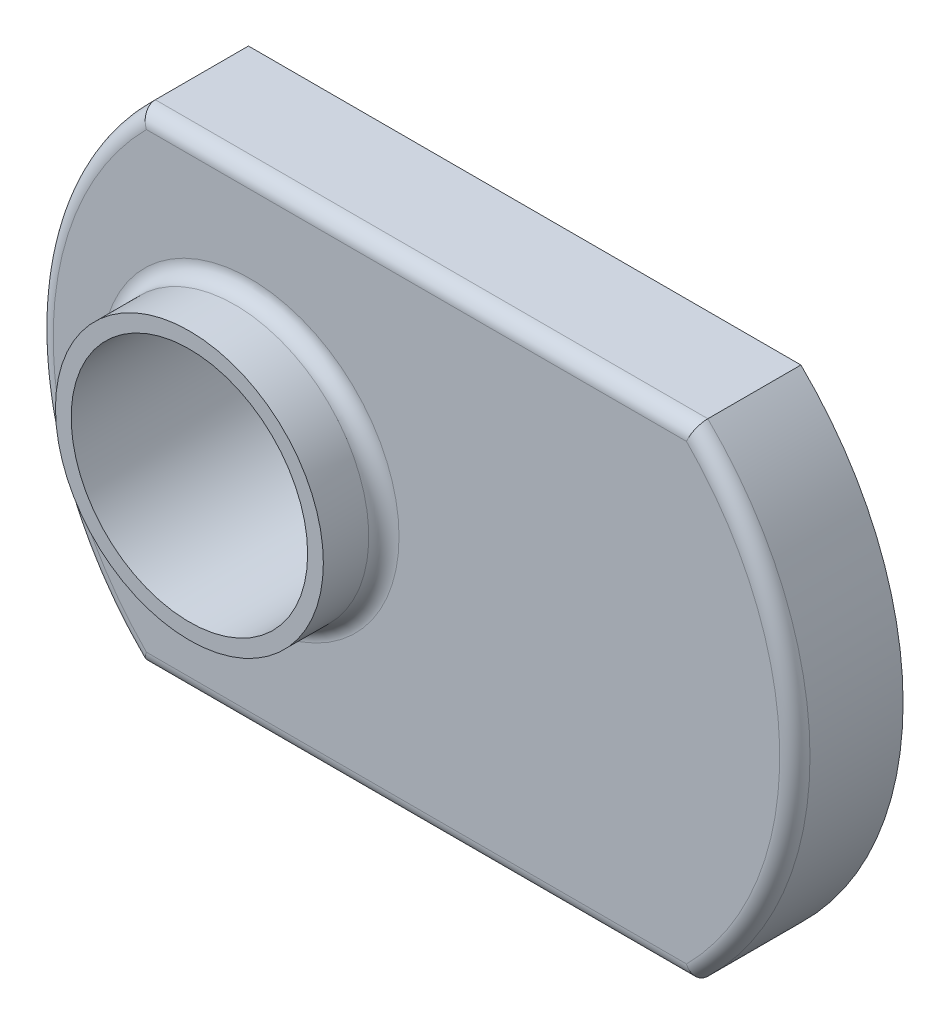
ISO-10303-21;
HEADER;
FILE_DESCRIPTION(('STEP AP214'),'2;1');
FILE_NAME('part.step','',(''),(''),'','','');
FILE_SCHEMA(('AUTOMOTIVE_DESIGN { 1 0 10303 214 1 1 1 1 }'));
ENDSEC;
DATA;
#1=APPLICATION_CONTEXT('core data for automotive mechanical design processes');
#2=APPLICATION_PROTOCOL_DEFINITION('international standard','automotive_design',2000,#1);
#3=PRODUCT_CONTEXT('',#1,'mechanical');
#4=PRODUCT('Part','Part','',(#3));
#5=PRODUCT_RELATED_PRODUCT_CATEGORY('part','',(#4));
#6=PRODUCT_DEFINITION_FORMATION('','',#4);
#7=PRODUCT_DEFINITION_CONTEXT('part definition',#1,'design');
#8=PRODUCT_DEFINITION('design','',#6,#7);
#9=PRODUCT_DEFINITION_SHAPE('','',#8);
#10=(LENGTH_UNIT() NAMED_UNIT(*) SI_UNIT(.MILLI.,.METRE.));
#11=(NAMED_UNIT(*) PLANE_ANGLE_UNIT() SI_UNIT($,.RADIAN.));
#12=(NAMED_UNIT(*) SI_UNIT($,.STERADIAN.) SOLID_ANGLE_UNIT());
#13=UNCERTAINTY_MEASURE_WITH_UNIT(LENGTH_MEASURE(1.E-05),#10,'distance_accuracy_value','');
#14=(GEOMETRIC_REPRESENTATION_CONTEXT(3) GLOBAL_UNCERTAINTY_ASSIGNED_CONTEXT((#13)) GLOBAL_UNIT_ASSIGNED_CONTEXT((#10,
#11,#12)) REPRESENTATION_CONTEXT('',''));
#15=CARTESIAN_POINT('',(0.,0.,0.));
#16=DIRECTION('',(0.,0.,1.));
#17=DIRECTION('',(1.,0.,0.));
#18=AXIS2_PLACEMENT_3D('',#15,#16,#17);
#19=CARTESIAN_POINT('',(0.,16.2052,-3.6322));
#20=DIRECTION('',(0.,0.,-1.));
#21=DIRECTION('',(-1.,0.,0.));
#22=AXIS2_PLACEMENT_3D('',#19,#20,#21);
#23=PLANE('',#22);
#24=CARTESIAN_POINT('',(11.2875718518519,8.1026,-3.6322));
#25=DIRECTION('',(0.,0.,-1.));
#26=DIRECTION('',(-1.,0.,0.));
#27=AXIS2_PLACEMENT_3D('',#24,#25,#26);
#28=CIRCLE('',#27,11.2875718518519);
#29=CARTESIAN_POINT('',(3.429,16.2052,-3.6322));
#30=VERTEX_POINT('',#29);
#31=CARTESIAN_POINT('',(3.429,0.,-3.6322));
#32=VERTEX_POINT('',#31);
#33=EDGE_CURVE('E94',#30,#32,#28,.F.);
#34=ORIENTED_EDGE('',*,*,#33,.F.);
#35=DIRECTION('',(-1.,0.,0.));
#36=VECTOR('',#35,1.);
#37=CARTESIAN_POINT('',(0.,16.2052,-3.6322));
#38=LINE('',#37,#36);
#39=CARTESIAN_POINT('',(21.971,16.2052,-3.6322));
#40=VERTEX_POINT('',#39);
#41=EDGE_CURVE('E90',#40,#30,#38,.T.);
#42=ORIENTED_EDGE('',*,*,#41,.F.);
#43=CARTESIAN_POINT('',(14.1124281481481,8.1026,-3.6322));
#44=DIRECTION('',(0.,0.,-1.));
#45=DIRECTION('',(-1.,0.,0.));
#46=AXIS2_PLACEMENT_3D('',#43,#44,#45);
#47=CIRCLE('',#46,11.2875718518519);
#48=CARTESIAN_POINT('',(21.971,0.,-3.6322));
#49=VERTEX_POINT('',#48);
#50=EDGE_CURVE('E93',#40,#49,#47,.T.);
#51=ORIENTED_EDGE('',*,*,#50,.T.);
#52=DIRECTION('',(1.,0.,0.));
#53=VECTOR('',#52,1.);
#54=CARTESIAN_POINT('',(0.,0.,-3.6322));
#55=LINE('',#54,#53);
#56=EDGE_CURVE('E106',#32,#49,#55,.T.);
#57=ORIENTED_EDGE('',*,*,#56,.F.);
#58=EDGE_LOOP('',(#34,#42,#51,#57));
#59=FACE_BOUND('',#58,.T.);
#60=CARTESIAN_POINT('',(7.112,8.1026,-3.6322));
#61=DIRECTION('',(0.,0.,-1.));
#62=DIRECTION('',(-1.,0.,0.));
#63=AXIS2_PLACEMENT_3D('',#60,#61,#62);
#64=CIRCLE('',#63,3.96875);
#65=CARTESIAN_POINT('',(3.14325,8.1026,-3.6322));
#66=VERTEX_POINT('',#65);
#67=EDGE_CURVE('E114',#66,#66,#64,.T.);
#68=ORIENTED_EDGE('',*,*,#67,.F.);
#69=EDGE_LOOP('',(#68));
#70=FACE_BOUND('',#69,.T.);
#71=ADVANCED_FACE('F30',(#59,#70),#23,.T.);
#72=CARTESIAN_POINT('',(0.,16.2052,0.));
#73=DIRECTION('',(0.,0.,-1.));
#74=DIRECTION('',(-1.,0.,0.));
#75=AXIS2_PLACEMENT_3D('',#72,#73,#74);
#76=PLANE('',#75);
#77=CARTESIAN_POINT('',(14.1124281481481,8.1026,0.));
#78=DIRECTION('',(0.,0.,-1.));
#79=DIRECTION('',(-1.,0.,0.));
#80=AXIS2_PLACEMENT_3D('',#77,#78,#79);
#81=CIRCLE('',#80,10.7795718518519);
#82=CARTESIAN_POINT('',(21.7623444973141,0.508000000000002,0.));
#83=VERTEX_POINT('',#82);
#84=CARTESIAN_POINT('',(21.7623444973141,15.6972,0.));
#85=VERTEX_POINT('',#84);
#86=EDGE_CURVE('E123',#83,#85,#81,.F.);
#87=ORIENTED_EDGE('',*,*,#86,.T.);
#88=DIRECTION('',(-1.,0.,0.));
#89=VECTOR('',#88,1.);
#90=CARTESIAN_POINT('',(3.429,15.6972,0.));
#91=LINE('',#90,#89);
#92=CARTESIAN_POINT('',(3.63765550268588,15.6972,0.));
#93=VERTEX_POINT('',#92);
#94=EDGE_CURVE('E125',#85,#93,#91,.T.);
#95=ORIENTED_EDGE('',*,*,#94,.T.);
#96=CARTESIAN_POINT('',(11.2875718518519,8.1026,0.));
#97=DIRECTION('',(0.,0.,-1.));
#98=DIRECTION('',(-1.,0.,0.));
#99=AXIS2_PLACEMENT_3D('',#96,#97,#98);
#100=CIRCLE('',#99,10.7795718518519);
#101=CARTESIAN_POINT('',(3.63765550268588,0.508000000000002,0.));
#102=VERTEX_POINT('',#101);
#103=EDGE_CURVE('E119',#93,#102,#100,.F.);
#104=ORIENTED_EDGE('',*,*,#103,.T.);
#105=DIRECTION('',(1.,0.,0.));
#106=VECTOR('',#105,1.);
#107=CARTESIAN_POINT('',(21.971,0.508000000000002,0.));
#108=LINE('',#107,#106);
#109=EDGE_CURVE('E121',#102,#83,#108,.T.);
#110=ORIENTED_EDGE('',*,*,#109,.T.);
#111=EDGE_LOOP('',(#87,#95,#104,#110));
#112=FACE_BOUND('',#111,.T.);
#113=CARTESIAN_POINT('',(7.112,8.1026,0.));
#114=DIRECTION('',(0.,0.,-1.));
#115=DIRECTION('',(-1.,0.,0.));
#116=AXIS2_PLACEMENT_3D('',#113,#114,#115);
#117=CIRCLE('',#116,5.0038);
#118=CARTESIAN_POINT('',(2.1082,8.1026,0.));
#119=VERTEX_POINT('',#118);
#120=EDGE_CURVE('E108',#119,#119,#117,.T.);
#121=ORIENTED_EDGE('',*,*,#120,.T.);
#122=EDGE_LOOP('',(#121));
#123=FACE_BOUND('',#122,.T.);
#124=ADVANCED_FACE('F200',(#112,#123),#76,.F.);
#125=CARTESIAN_POINT('',(0.,16.2052,-3.6322));
#126=DIRECTION('',(0.,1.,0.));
#127=DIRECTION('',(0.,0.,1.));
#128=AXIS2_PLACEMENT_3D('',#125,#126,#127);
#129=PLANE('',#128);
#130=DIRECTION('',(0.,0.,-1.));
#131=VECTOR('',#130,1.);
#132=CARTESIAN_POINT('',(3.429,16.2052,42.8615004012134));
#133=LINE('',#132,#131);
#134=CARTESIAN_POINT('',(3.429,16.2052,-0.507999999999995));
#135=VERTEX_POINT('',#134);
#136=EDGE_CURVE('E133',#135,#30,#133,.T.);
#137=ORIENTED_EDGE('',*,*,#136,.F.);
#138=DIRECTION('',(-1.,0.,0.));
#139=VECTOR('',#138,1.);
#140=CARTESIAN_POINT('',(21.971,16.2052,-0.508));
#141=LINE('',#140,#139);
#142=CARTESIAN_POINT('',(21.971,16.2052,-0.507999999999995));
#143=VERTEX_POINT('',#142);
#144=EDGE_CURVE('E92',#135,#143,#141,.F.);
#145=ORIENTED_EDGE('',*,*,#144,.T.);
#146=DIRECTION('',(0.,0.,-1.));
#147=VECTOR('',#146,1.);
#148=CARTESIAN_POINT('',(21.971,16.2052,42.8615004012134));
#149=LINE('',#148,#147);
#150=EDGE_CURVE('E85',#143,#40,#149,.T.);
#151=ORIENTED_EDGE('',*,*,#150,.T.);
#152=ORIENTED_EDGE('',*,*,#41,.T.);
#153=EDGE_LOOP('',(#137,#145,#151,#152));
#154=FACE_BOUND('',#153,.T.);
#155=ADVANCED_FACE('F88',(#154),#129,.T.);
#156=CARTESIAN_POINT('',(0.,0.,-3.6322));
#157=DIRECTION('',(0.,-1.,0.));
#158=DIRECTION('',(0.,0.,-1.));
#159=AXIS2_PLACEMENT_3D('',#156,#157,#158);
#160=PLANE('',#159);
#161=DIRECTION('',(0.,0.,-1.));
#162=VECTOR('',#161,1.);
#163=CARTESIAN_POINT('',(21.971,0.,42.8615004012134));
#164=LINE('',#163,#162);
#165=CARTESIAN_POINT('',(21.971,0.,-0.507999999999995));
#166=VERTEX_POINT('',#165);
#167=EDGE_CURVE('E98',#49,#166,#164,.F.);
#168=ORIENTED_EDGE('',*,*,#167,.T.);
#169=DIRECTION('',(1.,0.,0.));
#170=VECTOR('',#169,1.);
#171=CARTESIAN_POINT('',(3.429,0.,-0.508));
#172=LINE('',#171,#170);
#173=CARTESIAN_POINT('',(3.429,0.,-0.507999999999995));
#174=VERTEX_POINT('',#173);
#175=EDGE_CURVE('E45',#166,#174,#172,.F.);
#176=ORIENTED_EDGE('',*,*,#175,.T.);
#177=DIRECTION('',(0.,0.,-1.));
#178=VECTOR('',#177,1.);
#179=CARTESIAN_POINT('',(3.429,0.,42.8615004012134));
#180=LINE('',#179,#178);
#181=EDGE_CURVE('E134',#174,#32,#180,.T.);
#182=ORIENTED_EDGE('',*,*,#181,.T.);
#183=ORIENTED_EDGE('',*,*,#56,.T.);
#184=EDGE_LOOP('',(#168,#176,#182,#183));
#185=FACE_BOUND('',#184,.T.);
#186=ADVANCED_FACE('F32',(#185),#160,.T.);
#187=CARTESIAN_POINT('',(7.112,8.1026,2.032));
#188=DIRECTION('',(0.,0.,-1.));
#189=DIRECTION('',(-1.,0.,0.));
#190=AXIS2_PLACEMENT_3D('',#187,#188,#189);
#191=CYLINDRICAL_SURFACE('',#190,4.4958);
#192=CARTESIAN_POINT('',(7.112,8.1026,0.508));
#193=DIRECTION('',(0.,0.,-1.));
#194=DIRECTION('',(-1.,0.,0.));
#195=AXIS2_PLACEMENT_3D('',#192,#193,#194);
#196=CIRCLE('',#195,4.4958);
#197=CARTESIAN_POINT('',(2.6162,8.1026,0.508));
#198=VERTEX_POINT('',#197);
#199=EDGE_CURVE('E11',#198,#198,#196,.F.);
#200=ORIENTED_EDGE('',*,*,#199,.T.);
#201=EDGE_LOOP('',(#200));
#202=FACE_BOUND('',#201,.T.);
#203=CARTESIAN_POINT('',(7.112,8.1026,2.032));
#204=DIRECTION('',(0.,0.,1.));
#205=DIRECTION('',(1.,0.,0.));
#206=AXIS2_PLACEMENT_3D('',#203,#204,#205);
#207=CIRCLE('',#206,4.4958);
#208=CARTESIAN_POINT('',(11.6078,8.1026,2.032));
#209=VERTEX_POINT('',#208);
#210=EDGE_CURVE('E110',#209,#209,#207,.T.);
#211=ORIENTED_EDGE('',*,*,#210,.F.);
#212=EDGE_LOOP('',(#211));
#213=FACE_BOUND('',#212,.T.);
#214=ADVANCED_FACE('F195',(#202,#213),#191,.T.);
#215=CARTESIAN_POINT('',(7.112,8.1026,2.032));
#216=DIRECTION('',(0.,0.,1.));
#217=DIRECTION('',(1.,0.,0.));
#218=AXIS2_PLACEMENT_3D('',#215,#216,#217);
#219=PLANE('',#218);
#220=CARTESIAN_POINT('',(7.112,8.1026,2.032));
#221=DIRECTION('',(0.,0.,1.));
#222=DIRECTION('',(1.,0.,0.));
#223=AXIS2_PLACEMENT_3D('',#220,#221,#222);
#224=CIRCLE('',#223,3.96875);
#225=CARTESIAN_POINT('',(11.08075,8.1026,2.032));
#226=VERTEX_POINT('',#225);
#227=EDGE_CURVE('E101',#226,#226,#224,.T.);
#228=ORIENTED_EDGE('',*,*,#227,.F.);
#229=EDGE_LOOP('',(#228));
#230=FACE_BOUND('',#229,.T.);
#231=ORIENTED_EDGE('',*,*,#210,.T.);
#232=EDGE_LOOP('',(#231));
#233=FACE_BOUND('',#232,.T.);
#234=ADVANCED_FACE('F191',(#230,#233),#219,.T.);
#235=CARTESIAN_POINT('',(7.112,8.1026,2.032));
#236=DIRECTION('',(0.,0.,1.));
#237=DIRECTION('',(1.,0.,0.));
#238=AXIS2_PLACEMENT_3D('',#235,#236,#237);
#239=CYLINDRICAL_SURFACE('',#238,3.96875);
#240=ORIENTED_EDGE('',*,*,#67,.T.);
#241=EDGE_LOOP('',(#240));
#242=FACE_BOUND('',#241,.T.);
#243=ORIENTED_EDGE('',*,*,#227,.T.);
#244=EDGE_LOOP('',(#243));
#245=FACE_BOUND('',#244,.T.);
#246=ADVANCED_FACE('F188',(#242,#245),#239,.F.);
#247=CARTESIAN_POINT('',(14.1124281481481,8.1026,42.8615004012134));
#248=DIRECTION('',(0.,0.,-1.));
#249=DIRECTION('',(-1.,0.,0.));
#250=AXIS2_PLACEMENT_3D('',#247,#248,#249);
#251=CYLINDRICAL_SURFACE('',#250,11.2875718518519);
#252=ORIENTED_EDGE('',*,*,#150,.F.);
#253=CARTESIAN_POINT('',(14.1124281481481,8.1026,-0.508000000000002));
#254=DIRECTION('',(0.,0.,-1.));
#255=DIRECTION('',(-1.,0.,0.));
#256=AXIS2_PLACEMENT_3D('',#253,#254,#255);
#257=CIRCLE('',#256,11.2875718518519);
#258=EDGE_CURVE('E53',#143,#166,#257,.T.);
#259=ORIENTED_EDGE('',*,*,#258,.T.);
#260=ORIENTED_EDGE('',*,*,#167,.F.);
#261=ORIENTED_EDGE('',*,*,#50,.F.);
#262=EDGE_LOOP('',(#252,#259,#260,#261));
#263=FACE_BOUND('',#262,.T.);
#264=ADVANCED_FACE('F97',(#263),#251,.T.);
#265=CARTESIAN_POINT('',(11.2875718518519,8.1026,42.8615004012134));
#266=DIRECTION('',(0.,0.,-1.));
#267=DIRECTION('',(-1.,0.,0.));
#268=AXIS2_PLACEMENT_3D('',#265,#266,#267);
#269=CYLINDRICAL_SURFACE('',#268,11.2875718518519);
#270=ORIENTED_EDGE('',*,*,#181,.F.);
#271=CARTESIAN_POINT('',(11.2875718518519,8.1026,-0.508000000000002));
#272=DIRECTION('',(0.,0.,-1.));
#273=DIRECTION('',(-1.,0.,0.));
#274=AXIS2_PLACEMENT_3D('',#271,#272,#273);
#275=CIRCLE('',#274,11.2875718518519);
#276=EDGE_CURVE('E38',#174,#135,#275,.T.);
#277=ORIENTED_EDGE('',*,*,#276,.T.);
#278=ORIENTED_EDGE('',*,*,#136,.T.);
#279=ORIENTED_EDGE('',*,*,#33,.T.);
#280=EDGE_LOOP('',(#270,#277,#278,#279));
#281=FACE_BOUND('',#280,.T.);
#282=ADVANCED_FACE('F132',(#281),#269,.T.);
#283=CARTESIAN_POINT('',(0.,0.508000000000002,-0.508));
#284=DIRECTION('',(-1.,0.,0.));
#285=DIRECTION('',(0.,0.,1.));
#286=AXIS2_PLACEMENT_3D('',#283,#284,#285);
#287=CYLINDRICAL_SURFACE('',#286,0.508);
#288=CARTESIAN_POINT('',(3.429,0.,-0.507999999999995));
#289=CARTESIAN_POINT('',(3.42898831408873,-3.02343132654079E-05,-0.480934929983784));
#290=CARTESIAN_POINT('',(3.42987577116847,0.00216086007702355,-0.453889000468113));
#291=CARTESIAN_POINT('',(3.43335740954221,0.0107492954829233,-0.400658792363404));
#292=CARTESIAN_POINT('',(3.43594696420116,0.0171352340603573,-0.374472379461493));
#293=CARTESIAN_POINT('',(3.44274134413607,0.0338773223076329,-0.323635763879901));
#294=CARTESIAN_POINT('',(3.44694579866978,0.0442325607204053,-0.298985210112334));
#295=CARTESIAN_POINT('',(3.45681709724883,0.0685180262978959,-0.25183042009043));
#296=CARTESIAN_POINT('',(3.46248444429352,0.0824494830964695,-0.229326925730963));
#297=CARTESIAN_POINT('',(3.47528598456966,0.113875901195409,-0.186348043574764));
#298=CARTESIAN_POINT('',(3.48245873014562,0.131464376187394,-0.165952699341788));
#299=CARTESIAN_POINT('',(3.49794194273445,0.16936999407787,-0.128386630849486));
#300=CARTESIAN_POINT('',(3.50625278001051,0.18968802496053,-0.111216960350431));
#301=CARTESIAN_POINT('',(3.52439660201551,0.233965863636031,-0.0793222945148613));
#302=CARTESIAN_POINT('',(3.53429522356558,0.258080613690416,-0.064850019415531));
#303=CARTESIAN_POINT('',(3.55486750608426,0.308093893455235,-0.0401543570889611));
#304=CARTESIAN_POINT('',(3.56554140291015,0.333992965874879,-0.0299322692841549));
#305=CARTESIAN_POINT('',(3.5860563944548,0.38366169651262,-0.0148534143694712));
#306=CARTESIAN_POINT('',(3.59584002476985,0.407305197961299,-0.00949390641682595));
#307=CARTESIAN_POINT('',(3.61561193452468,0.454993018299731,-0.00219948352200265));
#308=CARTESIAN_POINT('',(3.62559977654523,0.479036463353435,-0.000257894868614071));
#309=CARTESIAN_POINT('',(3.63628448235962,0.504706755631485,-7.98828955047341E-06));
#310=CARTESIAN_POINT('',(3.6369699818245,0.5063534638078,1.90879874667295E-08));
#311=CARTESIAN_POINT('',(3.63765550268588,0.508000000000002,0.));
#312=B_SPLINE_CURVE_WITH_KNOTS('',3,(#288,#289,#290,#291,#292,#293,#294,#295,#296,#297,#298,
#299,#300,#301,#302,#303,#304,#305,#306,#307,#308,#309,#310,#311),.UNSPECIFIED.,.F.,.F.,(4,2,2,
2,2,2,2,2,2,2,2,4),(0.,0.0810625141558323,0.161905590691538,0.242730118680012,0.323582474389546,
0.406835152389662,0.490114980189399,0.579180713389819,0.668273656935,0.746487412321688,
0.824548280129319,0.829899325590328),.UNSPECIFIED.);
#313=EDGE_CURVE('E150',#174,#102,#312,.T.);
#314=ORIENTED_EDGE('',*,*,#313,.F.);
#315=ORIENTED_EDGE('',*,*,#175,.F.);
#316=CARTESIAN_POINT('',(21.971,0.,-0.507999999999995));
#317=CARTESIAN_POINT('',(21.9710116859113,-3.02343132652233E-05,-0.480934929983784));
#318=CARTESIAN_POINT('',(21.9701242288315,0.0021608600770237,-0.453889000468113));
#319=CARTESIAN_POINT('',(21.9666425904578,0.0107492954829232,-0.400658792363405));
#320=CARTESIAN_POINT('',(21.9640530357988,0.0171352340603572,-0.374472379461494));
#321=CARTESIAN_POINT('',(21.9572586558639,0.0338773223076327,-0.323635763879901));
#322=CARTESIAN_POINT('',(21.9530542013302,0.0442325607204051,-0.298985210112334));
#323=CARTESIAN_POINT('',(21.9431829027512,0.0685180262978957,-0.25183042009043));
#324=CARTESIAN_POINT('',(21.9375155557065,0.0824494830964691,-0.229326925730963));
#325=CARTESIAN_POINT('',(21.9247140154303,0.113875901195409,-0.186348043574764));
#326=CARTESIAN_POINT('',(21.9175412698544,0.131464376187394,-0.165952699341788));
#327=CARTESIAN_POINT('',(21.9020580572655,0.16936999407787,-0.128386630849486));
#328=CARTESIAN_POINT('',(21.8937472199895,0.189688024960529,-0.111216960350432));
#329=CARTESIAN_POINT('',(21.8756033979845,0.233965863636029,-0.0793222945148624));
#330=CARTESIAN_POINT('',(21.8657047764344,0.258080613690414,-0.0648500194155324));
#331=CARTESIAN_POINT('',(21.8451324939157,0.308093893455233,-0.0401543570889621));
#332=CARTESIAN_POINT('',(21.8344585970898,0.333992965874878,-0.0299322692841556));
#333=CARTESIAN_POINT('',(21.8139436055452,0.383661696512619,-0.0148534143694715));
#334=CARTESIAN_POINT('',(21.8041599752301,0.407305197961297,-0.00949390641682631));
#335=CARTESIAN_POINT('',(21.7843880654753,0.454993018299729,-0.00219948352200298));
#336=CARTESIAN_POINT('',(21.7744002234548,0.479036463353434,-0.000257894868614442));
#337=CARTESIAN_POINT('',(21.7637155176404,0.504706755631485,-7.98828955052097E-06));
#338=CARTESIAN_POINT('',(21.7630300181755,0.5063534638078,1.90879874416342E-08));
#339=CARTESIAN_POINT('',(21.7623444973141,0.508000000000002,0.));
#340=B_SPLINE_CURVE_WITH_KNOTS('',3,(#316,#317,#318,#319,#320,#321,#322,#323,#324,#325,#326,
#327,#328,#329,#330,#331,#332,#333,#334,#335,#336,#337,#338,#339),.UNSPECIFIED.,.F.,.F.,(4,2,2,
2,2,2,2,2,2,2,2,4),(0.,0.0810625141558318,0.161905590691538,0.242730118680011,0.323582474389545,
0.406835152389661,0.490114980189398,0.579180713389816,0.668273656934998,0.746487412321686,
0.824548280129319,0.829899325590328),.UNSPECIFIED.);
#341=EDGE_CURVE('E139',#83,#166,#340,.F.);
#342=ORIENTED_EDGE('',*,*,#341,.F.);
#343=ORIENTED_EDGE('',*,*,#109,.F.);
#344=EDGE_LOOP('',(#314,#315,#342,#343));
#345=FACE_BOUND('',#344,.T.);
#346=ADVANCED_FACE('F178',(#345),#287,.T.);
#347=CARTESIAN_POINT('',(14.1124281481481,8.1026,-0.508000000000002));
#348=DIRECTION('',(0.,0.,-1.));
#349=DIRECTION('',(-1.,0.,0.));
#350=AXIS2_PLACEMENT_3D('',#347,#348,#349);
#351=TOROIDAL_SURFACE('',#350,10.7795718518519,0.508);
#352=ORIENTED_EDGE('',*,*,#341,.T.);
#353=ORIENTED_EDGE('',*,*,#258,.F.);
#354=CARTESIAN_POINT('',(21.971,16.2052,-0.507999999999995));
#355=CARTESIAN_POINT('',(21.9710116859113,16.2052302343133,-0.480934929983784));
#356=CARTESIAN_POINT('',(21.9701242288315,16.203039139923,-0.453889000468113));
#357=CARTESIAN_POINT('',(21.9666425904578,16.1944507045171,-0.400658792363405));
#358=CARTESIAN_POINT('',(21.9640530357988,16.1880647659396,-0.374472379461494));
#359=CARTESIAN_POINT('',(21.9572586558639,16.1713226776924,-0.323635763879901));
#360=CARTESIAN_POINT('',(21.9530542013302,16.1609674392796,-0.298985210112334));
#361=CARTESIAN_POINT('',(21.9431829027512,16.1366819737021,-0.25183042009043));
#362=CARTESIAN_POINT('',(21.9375155557065,16.1227505169035,-0.229326925730963));
#363=CARTESIAN_POINT('',(21.9247140154303,16.0913240988046,-0.186348043574766));
#364=CARTESIAN_POINT('',(21.9175412698544,16.0737356238126,-0.165952699341791));
#365=CARTESIAN_POINT('',(21.9020580572656,16.0358300059221,-0.128386630849489));
#366=CARTESIAN_POINT('',(21.8937472199895,16.0155119750395,-0.111216960350434));
#367=CARTESIAN_POINT('',(21.8756033979845,15.971234136364,-0.079322294514863));
#368=CARTESIAN_POINT('',(21.8657047764344,15.9471193863096,-0.0648500194155332));
#369=CARTESIAN_POINT('',(21.8451324939157,15.8971061065448,-0.0401543570889628));
#370=CARTESIAN_POINT('',(21.8344585970899,15.8712070341251,-0.0299322692841559));
#371=CARTESIAN_POINT('',(21.8139436055452,15.8215383034874,-0.0148534143694715));
#372=CARTESIAN_POINT('',(21.8041599752301,15.7978948020387,-0.0094939064168262));
#373=CARTESIAN_POINT('',(21.7843880654753,15.7502069817003,-0.00219948352200249));
#374=CARTESIAN_POINT('',(21.7744002234548,15.7261635366466,-0.000257894868613813));
#375=CARTESIAN_POINT('',(21.7637155176404,15.7004932443685,-7.98828955045074E-06));
#376=CARTESIAN_POINT('',(21.7630300181755,15.6988465361922,1.90879874735701E-08));
#377=CARTESIAN_POINT('',(21.7623444973141,15.6972,0.));
#378=B_SPLINE_CURVE_WITH_KNOTS('',3,(#354,#355,#356,#357,#358,#359,#360,#361,#362,#363,#364,
#365,#366,#367,#368,#369,#370,#371,#372,#373,#374,#375,#376,#377),.UNSPECIFIED.,.F.,.F.,(4,2,2,
2,2,2,2,2,2,2,2,4),(0.,0.0810625141558324,0.161905590691538,0.242730118680011,0.323582474389544,
0.406835152389658,0.490114980189395,0.579180713389814,0.668273656934999,0.746487412321687,
0.824548280129323,0.829899325590328),.UNSPECIFIED.);
#379=EDGE_CURVE('E147',#85,#143,#378,.F.);
#380=ORIENTED_EDGE('',*,*,#379,.F.);
#381=ORIENTED_EDGE('',*,*,#86,.F.);
#382=EDGE_LOOP('',(#352,#353,#380,#381));
#383=FACE_BOUND('',#382,.T.);
#384=ADVANCED_FACE('F166',(#383),#351,.T.);
#385=CARTESIAN_POINT('',(11.2875718518519,8.1026,-0.508000000000002));
#386=DIRECTION('',(0.,0.,-1.));
#387=DIRECTION('',(-1.,0.,0.));
#388=AXIS2_PLACEMENT_3D('',#385,#386,#387);
#389=TOROIDAL_SURFACE('',#388,10.7795718518519,0.508);
#390=ORIENTED_EDGE('',*,*,#313,.T.);
#391=ORIENTED_EDGE('',*,*,#103,.F.);
#392=CARTESIAN_POINT('',(3.429,16.2052,-0.507999999999995));
#393=CARTESIAN_POINT('',(3.42898831408873,16.2052302343133,-0.480934929983784));
#394=CARTESIAN_POINT('',(3.42987577116847,16.203039139923,-0.453889000468113));
#395=CARTESIAN_POINT('',(3.4333574095422,16.1944507045171,-0.400658792363404));
#396=CARTESIAN_POINT('',(3.43594696420116,16.1880647659396,-0.374472379461494));
#397=CARTESIAN_POINT('',(3.44274134413607,16.1713226776924,-0.323635763879901));
#398=CARTESIAN_POINT('',(3.44694579866977,16.1609674392796,-0.298985210112334));
#399=CARTESIAN_POINT('',(3.45681709724882,16.1366819737021,-0.25183042009043));
#400=CARTESIAN_POINT('',(3.46248444429352,16.1227505169035,-0.229326925730964));
#401=CARTESIAN_POINT('',(3.47528598456966,16.0913240988046,-0.186348043574765));
#402=CARTESIAN_POINT('',(3.48245873014562,16.0737356238126,-0.165952699341789));
#403=CARTESIAN_POINT('',(3.49794194273445,16.0358300059221,-0.128386630849487));
#404=CARTESIAN_POINT('',(3.50625278001051,16.0155119750395,-0.111216960350432));
#405=CARTESIAN_POINT('',(3.52439660201551,15.971234136364,-0.0793222945148627));
#406=CARTESIAN_POINT('',(3.53429522356558,15.9471193863096,-0.0648500194155328));
#407=CARTESIAN_POINT('',(3.55486750608425,15.8971061065448,-0.0401543570889625));
#408=CARTESIAN_POINT('',(3.56554140291014,15.8712070341251,-0.0299322692841558));
#409=CARTESIAN_POINT('',(3.5860563944548,15.8215383034874,-0.0148534143694712));
#410=CARTESIAN_POINT('',(3.59584002476985,15.7978948020387,-0.00949390641682582));
#411=CARTESIAN_POINT('',(3.61561193452467,15.7502069817003,-0.00219948352200252));
#412=CARTESIAN_POINT('',(3.62559977654522,15.7261635366466,-0.000257894868613955));
#413=CARTESIAN_POINT('',(3.63628448235962,15.7004932443685,-7.98828955046852E-06));
#414=CARTESIAN_POINT('',(3.6369699818245,15.6988465361922,1.90879874647464E-08));
#415=CARTESIAN_POINT('',(3.63765550268588,15.6972,0.));
#416=B_SPLINE_CURVE_WITH_KNOTS('',3,(#392,#393,#394,#395,#396,#397,#398,#399,#400,#401,#402,
#403,#404,#405,#406,#407,#408,#409,#410,#411,#412,#413,#414,#415),.UNSPECIFIED.,.F.,.F.,(4,2,2,
2,2,2,2,2,2,2,2,4),(0.,0.0810625141558323,0.161905590691538,0.242730118680011,0.323582474389544,
0.40683515238966,0.490114980189399,0.579180713389817,0.668273656934998,0.74648741232169,
0.824548280129322,0.829899325590328),.UNSPECIFIED.);
#417=EDGE_CURVE('E144',#135,#93,#416,.T.);
#418=ORIENTED_EDGE('',*,*,#417,.F.);
#419=ORIENTED_EDGE('',*,*,#276,.F.);
#420=EDGE_LOOP('',(#390,#391,#418,#419));
#421=FACE_BOUND('',#420,.T.);
#422=ADVANCED_FACE('F148',(#421),#389,.T.);
#423=CARTESIAN_POINT('',(0.,15.6972,-0.508));
#424=DIRECTION('',(1.,0.,0.));
#425=DIRECTION('',(0.,0.,-1.));
#426=AXIS2_PLACEMENT_3D('',#423,#424,#425);
#427=CYLINDRICAL_SURFACE('',#426,0.508);
#428=ORIENTED_EDGE('',*,*,#379,.T.);
#429=ORIENTED_EDGE('',*,*,#144,.F.);
#430=ORIENTED_EDGE('',*,*,#417,.T.);
#431=ORIENTED_EDGE('',*,*,#94,.F.);
#432=EDGE_LOOP('',(#428,#429,#430,#431));
#433=FACE_BOUND('',#432,.T.);
#434=ADVANCED_FACE('F142',(#433),#427,.T.);
#435=CARTESIAN_POINT('',(7.112,8.1026,0.508));
#436=DIRECTION('',(0.,0.,-1.));
#437=DIRECTION('',(-1.,0.,0.));
#438=AXIS2_PLACEMENT_3D('',#435,#436,#437);
#439=TOROIDAL_SURFACE('',#438,5.0038,0.508);
#440=ORIENTED_EDGE('',*,*,#120,.F.);
#441=EDGE_LOOP('',(#440));
#442=FACE_BOUND('',#441,.T.);
#443=ORIENTED_EDGE('',*,*,#199,.F.);
#444=EDGE_LOOP('',(#443));
#445=FACE_BOUND('',#444,.T.);
#446=ADVANCED_FACE('F219',(#442,#445),#439,.F.);
#447=CLOSED_SHELL('',(#71,#124,#155,#186,#214,#234,#246,#264,#282,#346,#384,#422,#434,#446));
#448=MANIFOLD_SOLID_BREP('B2',#447);
#449=ADVANCED_BREP_SHAPE_REPRESENTATION('',(#18,#448),#14);
#450=SHAPE_DEFINITION_REPRESENTATION(#9,#449);
ENDSEC;
END-ISO-10303-21;
